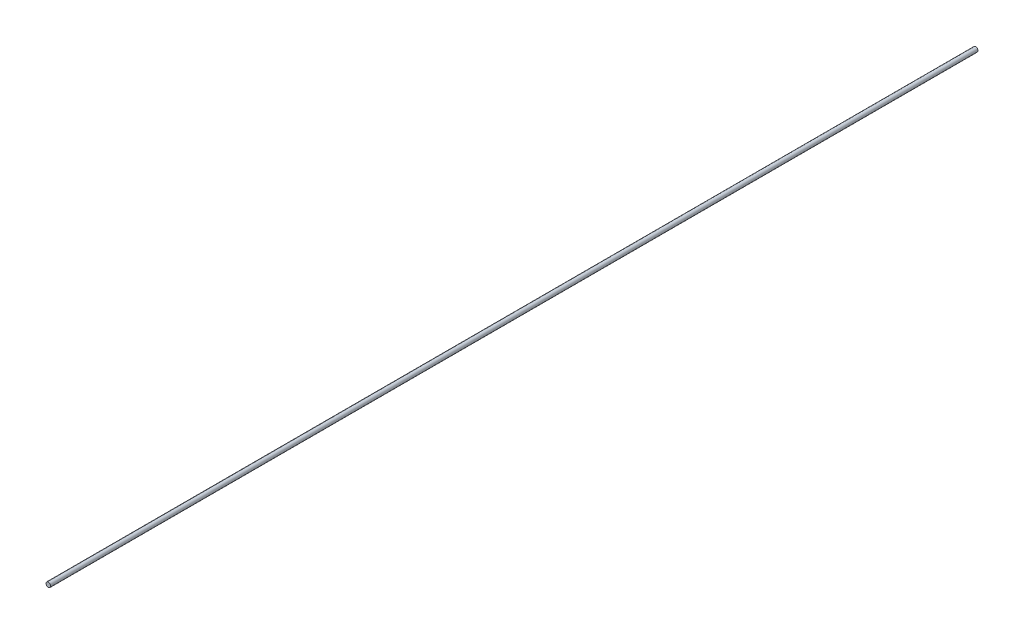
ISO-10303-21;
HEADER;
FILE_DESCRIPTION(('STEP AP214'),'2;1');
FILE_NAME('part.step','',(''),(''),'','','');
FILE_SCHEMA(('AUTOMOTIVE_DESIGN { 1 0 10303 214 1 1 1 1 }'));
ENDSEC;
DATA;
#1=APPLICATION_CONTEXT('core data for automotive mechanical design processes');
#2=APPLICATION_PROTOCOL_DEFINITION('international standard','automotive_design',2000,#1);
#3=PRODUCT_CONTEXT('',#1,'mechanical');
#4=PRODUCT('Part','Part','',(#3));
#5=PRODUCT_RELATED_PRODUCT_CATEGORY('part','',(#4));
#6=PRODUCT_DEFINITION_FORMATION('','',#4);
#7=PRODUCT_DEFINITION_CONTEXT('part definition',#1,'design');
#8=PRODUCT_DEFINITION('design','',#6,#7);
#9=PRODUCT_DEFINITION_SHAPE('','',#8);
#10=(LENGTH_UNIT() NAMED_UNIT(*) SI_UNIT(.MILLI.,.METRE.));
#11=(NAMED_UNIT(*) PLANE_ANGLE_UNIT() SI_UNIT($,.RADIAN.));
#12=(NAMED_UNIT(*) SI_UNIT($,.STERADIAN.) SOLID_ANGLE_UNIT());
#13=UNCERTAINTY_MEASURE_WITH_UNIT(LENGTH_MEASURE(1.E-05),#10,'distance_accuracy_value','');
#14=(GEOMETRIC_REPRESENTATION_CONTEXT(3) GLOBAL_UNCERTAINTY_ASSIGNED_CONTEXT((#13)) GLOBAL_UNIT_ASSIGNED_CONTEXT((#10,
#11,#12)) REPRESENTATION_CONTEXT('',''));
#15=CARTESIAN_POINT('',(0.,0.,0.));
#16=DIRECTION('',(0.,0.,1.));
#17=DIRECTION('',(1.,0.,0.));
#18=AXIS2_PLACEMENT_3D('',#15,#16,#17);
#19=CARTESIAN_POINT('',(0.,0.,800.));
#20=DIRECTION('',(0.,0.,-1.));
#21=DIRECTION('',(-1.,0.,0.));
#22=AXIS2_PLACEMENT_3D('',#19,#20,#21);
#23=CYLINDRICAL_SURFACE('',#22,2.);
#24=CARTESIAN_POINT('',(0.,0.,800.));
#25=DIRECTION('',(0.,0.,1.));
#26=DIRECTION('',(1.,0.,0.));
#27=AXIS2_PLACEMENT_3D('',#24,#25,#26);
#28=CIRCLE('',#27,2.);
#29=CARTESIAN_POINT('',(2.,0.,800.));
#30=VERTEX_POINT('',#29);
#31=EDGE_CURVE('E10',#30,#30,#28,.T.);
#32=ORIENTED_EDGE('',*,*,#31,.F.);
#33=EDGE_LOOP('',(#32));
#34=FACE_BOUND('',#33,.T.);
#35=CARTESIAN_POINT('',(0.,0.,0.));
#36=DIRECTION('',(0.,0.,1.));
#37=DIRECTION('',(1.,0.,0.));
#38=AXIS2_PLACEMENT_3D('',#35,#36,#37);
#39=CIRCLE('',#38,2.);
#40=CARTESIAN_POINT('',(2.,0.,0.));
#41=VERTEX_POINT('',#40);
#42=EDGE_CURVE('E36',#41,#41,#39,.T.);
#43=ORIENTED_EDGE('',*,*,#42,.T.);
#44=EDGE_LOOP('',(#43));
#45=FACE_BOUND('',#44,.T.);
#46=ADVANCED_FACE('F33',(#34,#45),#23,.T.);
#47=CARTESIAN_POINT('',(0.,0.,800.));
#48=DIRECTION('',(0.,0.,1.));
#49=DIRECTION('',(1.,0.,0.));
#50=AXIS2_PLACEMENT_3D('',#47,#48,#49);
#51=PLANE('',#50);
#52=ORIENTED_EDGE('',*,*,#31,.T.);
#53=EDGE_LOOP('',(#52));
#54=FACE_BOUND('',#53,.T.);
#55=ADVANCED_FACE('F48',(#54),#51,.T.);
#56=CARTESIAN_POINT('',(0.,0.,0.));
#57=DIRECTION('',(0.,0.,1.));
#58=DIRECTION('',(1.,0.,0.));
#59=AXIS2_PLACEMENT_3D('',#56,#57,#58);
#60=PLANE('',#59);
#61=ORIENTED_EDGE('',*,*,#42,.F.);
#62=EDGE_LOOP('',(#61));
#63=FACE_BOUND('',#62,.T.);
#64=ADVANCED_FACE('F46',(#63),#60,.F.);
#65=CLOSED_SHELL('',(#46,#55,#64));
#66=MANIFOLD_SOLID_BREP('B2',#65);
#67=ADVANCED_BREP_SHAPE_REPRESENTATION('',(#18,#66),#14);
#68=SHAPE_DEFINITION_REPRESENTATION(#9,#67);
ENDSEC;
END-ISO-10303-21;
